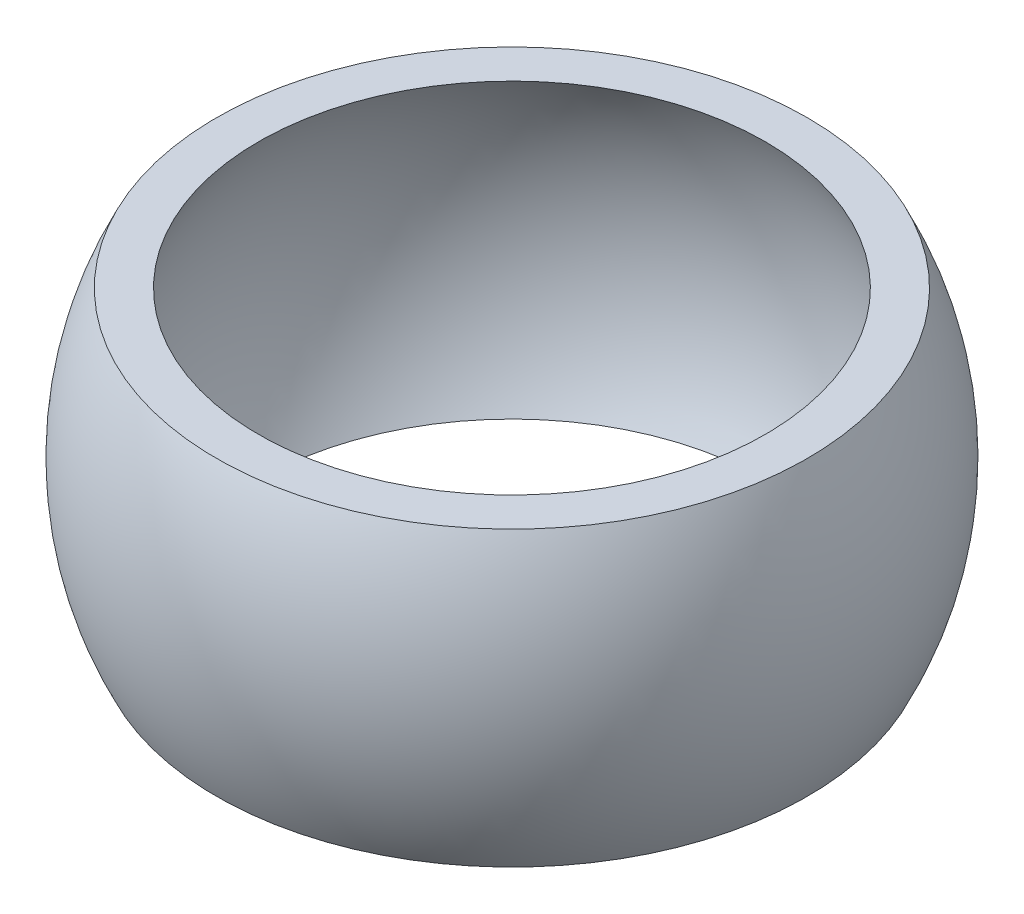
ISO-10303-21;
HEADER;
FILE_DESCRIPTION(('STEP AP214'),'2;1');
FILE_NAME('part.step','',(''),(''),'','','');
FILE_SCHEMA(('AUTOMOTIVE_DESIGN { 1 0 10303 214 1 1 1 1 }'));
ENDSEC;
DATA;
#1=APPLICATION_CONTEXT('core data for automotive mechanical design processes');
#2=APPLICATION_PROTOCOL_DEFINITION('international standard','automotive_design',2000,#1);
#3=PRODUCT_CONTEXT('',#1,'mechanical');
#4=PRODUCT('Part','Part','',(#3));
#5=PRODUCT_RELATED_PRODUCT_CATEGORY('part','',(#4));
#6=PRODUCT_DEFINITION_FORMATION('','',#4);
#7=PRODUCT_DEFINITION_CONTEXT('part definition',#1,'design');
#8=PRODUCT_DEFINITION('design','',#6,#7);
#9=PRODUCT_DEFINITION_SHAPE('','',#8);
#10=(LENGTH_UNIT() NAMED_UNIT(*) SI_UNIT(.MILLI.,.METRE.));
#11=(NAMED_UNIT(*) PLANE_ANGLE_UNIT() SI_UNIT($,.RADIAN.));
#12=(NAMED_UNIT(*) SI_UNIT($,.STERADIAN.) SOLID_ANGLE_UNIT());
#13=UNCERTAINTY_MEASURE_WITH_UNIT(LENGTH_MEASURE(1.E-05),#10,'distance_accuracy_value','');
#14=(GEOMETRIC_REPRESENTATION_CONTEXT(3) GLOBAL_UNCERTAINTY_ASSIGNED_CONTEXT((#13)) GLOBAL_UNIT_ASSIGNED_CONTEXT((#10,
#11,#12)) REPRESENTATION_CONTEXT('',''));
#15=CARTESIAN_POINT('',(0.,0.,0.));
#16=DIRECTION('',(0.,0.,1.));
#17=DIRECTION('',(1.,0.,0.));
#18=AXIS2_PLACEMENT_3D('',#15,#16,#17);
#19=CARTESIAN_POINT('',(0.,0.,0.));
#20=DIRECTION('',(0.,-1.,0.));
#21=DIRECTION('',(1.,0.,0.));
#22=AXIS2_PLACEMENT_3D('',#19,#20,#21);
#23=SPHERICAL_SURFACE('',#22,14.);
#24=CARTESIAN_POINT('',(0.,-7.,0.));
#25=DIRECTION('',(0.,-1.,0.));
#26=DIRECTION('',(0.,0.,-1.));
#27=AXIS2_PLACEMENT_3D('',#24,#25,#26);
#28=CIRCLE('',#27,12.1243556529821);
#29=CARTESIAN_POINT('',(0.,-7.,-12.1243556529821));
#30=VERTEX_POINT('',#29);
#31=EDGE_CURVE('E47',#30,#30,#28,.T.);
#32=ORIENTED_EDGE('',*,*,#31,.T.);
#33=EDGE_LOOP('',(#32));
#34=FACE_BOUND('',#33,.T.);
#35=CARTESIAN_POINT('',(0.,7.,0.));
#36=DIRECTION('',(0.,-1.,0.));
#37=DIRECTION('',(0.,0.,-1.));
#38=AXIS2_PLACEMENT_3D('',#35,#36,#37);
#39=CIRCLE('',#38,12.1243556529821);
#40=CARTESIAN_POINT('',(0.,7.,-12.1243556529821));
#41=VERTEX_POINT('',#40);
#42=EDGE_CURVE('E10',#41,#41,#39,.T.);
#43=ORIENTED_EDGE('',*,*,#42,.F.);
#44=EDGE_LOOP('',(#43));
#45=FACE_BOUND('',#44,.T.);
#46=ADVANCED_FACE('F33',(#34,#45),#23,.F.);
#47=CARTESIAN_POINT('',(12.1243556529821,7.,0.));
#48=DIRECTION('',(0.,1.,0.));
#49=DIRECTION('',(0.,0.,1.));
#50=AXIS2_PLACEMENT_3D('',#47,#48,#49);
#51=PLANE('',#50);
#52=ORIENTED_EDGE('',*,*,#42,.T.);
#53=EDGE_LOOP('',(#52));
#54=FACE_BOUND('',#53,.T.);
#55=CARTESIAN_POINT('',(0.,7.,0.));
#56=DIRECTION('',(0.,-1.,0.));
#57=DIRECTION('',(0.,0.,-1.));
#58=AXIS2_PLACEMENT_3D('',#55,#56,#57);
#59=CIRCLE('',#58,14.1243556529821);
#60=CARTESIAN_POINT('',(0.,7.,-14.1243556529821));
#61=VERTEX_POINT('',#60);
#62=EDGE_CURVE('E39',#61,#61,#59,.T.);
#63=ORIENTED_EDGE('',*,*,#62,.F.);
#64=EDGE_LOOP('',(#63));
#65=FACE_BOUND('',#64,.T.);
#66=ADVANCED_FACE('F63',(#54,#65),#51,.T.);
#67=CARTESIAN_POINT('',(0.,0.,0.));
#68=DIRECTION('',(0.,-1.,0.));
#69=DIRECTION('',(1.,0.,0.));
#70=AXIS2_PLACEMENT_3D('',#67,#68,#69);
#71=SPHERICAL_SURFACE('',#70,15.7638010204369);
#72=ORIENTED_EDGE('',*,*,#62,.T.);
#73=EDGE_LOOP('',(#72));
#74=FACE_BOUND('',#73,.T.);
#75=CARTESIAN_POINT('',(0.,-7.,0.));
#76=DIRECTION('',(0.,-1.,0.));
#77=DIRECTION('',(0.,0.,-1.));
#78=AXIS2_PLACEMENT_3D('',#75,#76,#77);
#79=CIRCLE('',#78,14.1243556529821);
#80=CARTESIAN_POINT('',(0.,-7.,-14.1243556529821));
#81=VERTEX_POINT('',#80);
#82=EDGE_CURVE('E43',#81,#81,#79,.T.);
#83=ORIENTED_EDGE('',*,*,#82,.F.);
#84=EDGE_LOOP('',(#83));
#85=FACE_BOUND('',#84,.T.);
#86=ADVANCED_FACE('F57',(#74,#85),#71,.T.);
#87=CARTESIAN_POINT('',(12.1243556529821,-7.,0.));
#88=DIRECTION('',(0.,-1.,0.));
#89=DIRECTION('',(0.,0.,-1.));
#90=AXIS2_PLACEMENT_3D('',#87,#88,#89);
#91=PLANE('',#90);
#92=ORIENTED_EDGE('',*,*,#82,.T.);
#93=EDGE_LOOP('',(#92));
#94=FACE_BOUND('',#93,.T.);
#95=ORIENTED_EDGE('',*,*,#31,.F.);
#96=EDGE_LOOP('',(#95));
#97=FACE_BOUND('',#96,.T.);
#98=ADVANCED_FACE('F55',(#94,#97),#91,.T.);
#99=CLOSED_SHELL('',(#46,#66,#86,#98));
#100=MANIFOLD_SOLID_BREP('B2',#99);
#101=ADVANCED_BREP_SHAPE_REPRESENTATION('',(#18,#100),#14);
#102=SHAPE_DEFINITION_REPRESENTATION(#9,#101);
ENDSEC;
END-ISO-10303-21;
